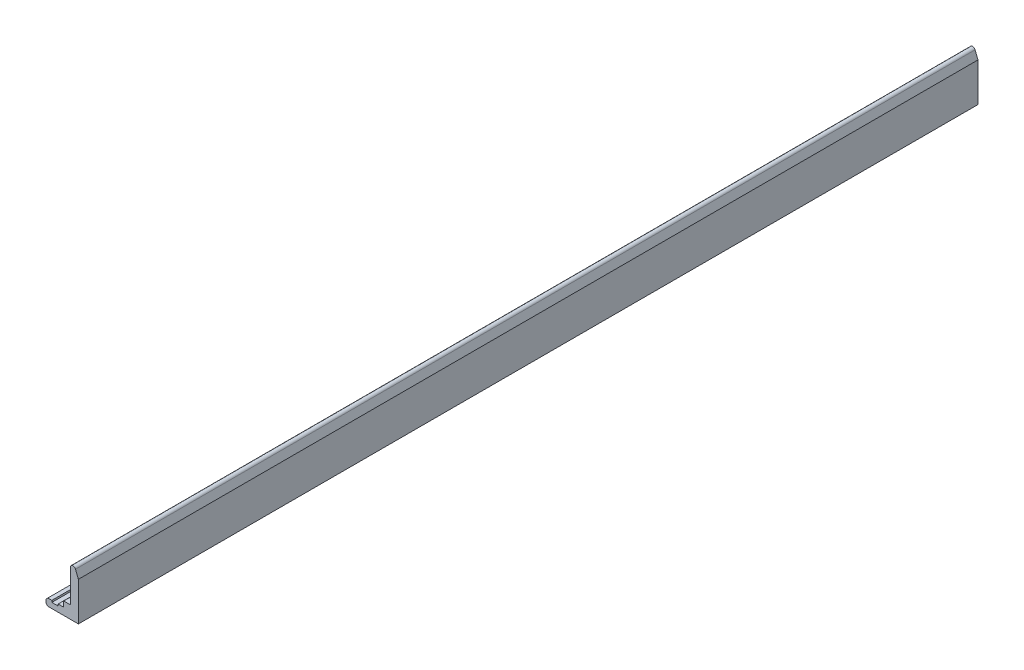
ISO-10303-21;
HEADER;
FILE_DESCRIPTION(('STEP AP214'),'2;1');
FILE_NAME('part.step','',(''),(''),'','','');
FILE_SCHEMA(('AUTOMOTIVE_DESIGN { 1 0 10303 214 1 1 1 1 }'));
ENDSEC;
DATA;
#1=APPLICATION_CONTEXT('core data for automotive mechanical design processes');
#2=APPLICATION_PROTOCOL_DEFINITION('international standard','automotive_design',2000,#1);
#3=PRODUCT_CONTEXT('',#1,'mechanical');
#4=PRODUCT('Part','Part','',(#3));
#5=PRODUCT_RELATED_PRODUCT_CATEGORY('part','',(#4));
#6=PRODUCT_DEFINITION_FORMATION('','',#4);
#7=PRODUCT_DEFINITION_CONTEXT('part definition',#1,'design');
#8=PRODUCT_DEFINITION('design','',#6,#7);
#9=PRODUCT_DEFINITION_SHAPE('','',#8);
#10=(LENGTH_UNIT() NAMED_UNIT(*) SI_UNIT(.MILLI.,.METRE.));
#11=(NAMED_UNIT(*) PLANE_ANGLE_UNIT() SI_UNIT($,.RADIAN.));
#12=(NAMED_UNIT(*) SI_UNIT($,.STERADIAN.) SOLID_ANGLE_UNIT());
#13=UNCERTAINTY_MEASURE_WITH_UNIT(LENGTH_MEASURE(1.E-05),#10,'distance_accuracy_value','');
#14=(GEOMETRIC_REPRESENTATION_CONTEXT(3) GLOBAL_UNCERTAINTY_ASSIGNED_CONTEXT((#13)) GLOBAL_UNIT_ASSIGNED_CONTEXT((#10,
#11,#12)) REPRESENTATION_CONTEXT('',''));
#15=CARTESIAN_POINT('',(0.,0.,0.));
#16=DIRECTION('',(0.,0.,1.));
#17=DIRECTION('',(1.,0.,0.));
#18=AXIS2_PLACEMENT_3D('',#15,#16,#17);
#19=CARTESIAN_POINT('',(14.694282023086,-76.931131619434,0.));
#20=DIRECTION('',(0.,1.,0.));
#21=DIRECTION('',(-1.,0.,0.));
#22=AXIS2_PLACEMENT_3D('',#19,#20,#21);
#23=PLANE('',#22);
#24=DIRECTION('',(1.,0.,0.));
#25=VECTOR('',#24,1.);
#26=CARTESIAN_POINT('',(14.344282023086,-76.931131619434,100.));
#27=LINE('',#26,#25);
#28=CARTESIAN_POINT('',(13.994282023086,-76.931131619434,100.));
#29=VERTEX_POINT('',#28);
#30=CARTESIAN_POINT('',(14.694282023086,-76.931131619434,100.));
#31=VERTEX_POINT('',#30);
#32=EDGE_CURVE('E253',#29,#31,#27,.T.);
#33=ORIENTED_EDGE('',*,*,#32,.T.);
#34=DIRECTION('',(0.,0.,1.));
#35=VECTOR('',#34,1.);
#36=CARTESIAN_POINT('',(14.694282023086,-76.931131619434,50.));
#37=LINE('',#36,#35);
#38=CARTESIAN_POINT('',(14.694282023086,-76.931131619434,0.));
#39=VERTEX_POINT('',#38);
#40=EDGE_CURVE('E247',#39,#31,#37,.T.);
#41=ORIENTED_EDGE('',*,*,#40,.F.);
#42=DIRECTION('',(-1.,0.,0.));
#43=VECTOR('',#42,1.);
#44=CARTESIAN_POINT('',(14.344282023086,-76.931131619434,0.));
#45=LINE('',#44,#43);
#46=CARTESIAN_POINT('',(13.994282023086,-76.931131619434,0.));
#47=VERTEX_POINT('',#46);
#48=EDGE_CURVE('E261',#39,#47,#45,.T.);
#49=ORIENTED_EDGE('',*,*,#48,.T.);
#50=DIRECTION('',(0.,0.,-1.));
#51=VECTOR('',#50,1.);
#52=CARTESIAN_POINT('',(13.994282023086,-76.931131619434,50.));
#53=LINE('',#52,#51);
#54=EDGE_CURVE('E237',#29,#47,#53,.T.);
#55=ORIENTED_EDGE('',*,*,#54,.F.);
#56=EDGE_LOOP('',(#33,#41,#49,#55));
#57=FACE_BOUND('',#56,.T.);
#58=ADVANCED_FACE('F17',(#57),#23,.T.);
#59=CARTESIAN_POINT('',(14.694282023086,-76.731131619434,0.));
#60=DIRECTION('',(-1.,0.,0.));
#61=DIRECTION('',(0.,-1.,0.));
#62=AXIS2_PLACEMENT_3D('',#59,#60,#61);
#63=PLANE('',#62);
#64=DIRECTION('',(0.,1.,0.));
#65=VECTOR('',#64,1.);
#66=CARTESIAN_POINT('',(14.694282023086,-76.831131619434,100.));
#67=LINE('',#66,#65);
#68=CARTESIAN_POINT('',(14.694282023086,-76.731131619434,100.));
#69=VERTEX_POINT('',#68);
#70=EDGE_CURVE('E244',#31,#69,#67,.T.);
#71=ORIENTED_EDGE('',*,*,#70,.T.);
#72=DIRECTION('',(0.,0.,1.));
#73=VECTOR('',#72,1.);
#74=CARTESIAN_POINT('',(14.694282023086,-76.731131619434,50.));
#75=LINE('',#74,#73);
#76=CARTESIAN_POINT('',(14.694282023086,-76.731131619434,0.));
#77=VERTEX_POINT('',#76);
#78=EDGE_CURVE('E231',#77,#69,#75,.T.);
#79=ORIENTED_EDGE('',*,*,#78,.F.);
#80=DIRECTION('',(0.,-1.,0.));
#81=VECTOR('',#80,1.);
#82=CARTESIAN_POINT('',(14.694282023086,-76.831131619434,0.));
#83=LINE('',#82,#81);
#84=EDGE_CURVE('E250',#77,#39,#83,.T.);
#85=ORIENTED_EDGE('',*,*,#84,.T.);
#86=ORIENTED_EDGE('',*,*,#40,.T.);
#87=EDGE_LOOP('',(#71,#79,#85,#86));
#88=FACE_BOUND('',#87,.T.);
#89=ADVANCED_FACE('F326',(#88),#63,.T.);
#90=CARTESIAN_POINT('',(13.994282023086,-76.931131619434,0.));
#91=DIRECTION('',(1.,0.,0.));
#92=DIRECTION('',(0.,1.,0.));
#93=AXIS2_PLACEMENT_3D('',#90,#91,#92);
#94=PLANE('',#93);
#95=DIRECTION('',(0.,-1.,0.));
#96=VECTOR('',#95,1.);
#97=CARTESIAN_POINT('',(13.994282023086,-76.831131619434,100.));
#98=LINE('',#97,#96);
#99=CARTESIAN_POINT('',(13.994282023086,-76.731131619434,100.));
#100=VERTEX_POINT('',#99);
#101=EDGE_CURVE('E270',#100,#29,#98,.T.);
#102=ORIENTED_EDGE('',*,*,#101,.T.);
#103=ORIENTED_EDGE('',*,*,#54,.T.);
#104=DIRECTION('',(0.,1.,0.));
#105=VECTOR('',#104,1.);
#106=CARTESIAN_POINT('',(13.994282023086,-76.831131619434,0.));
#107=LINE('',#106,#105);
#108=CARTESIAN_POINT('',(13.994282023086,-76.731131619434,0.));
#109=VERTEX_POINT('',#108);
#110=EDGE_CURVE('E246',#47,#109,#107,.T.);
#111=ORIENTED_EDGE('',*,*,#110,.T.);
#112=DIRECTION('',(0.,0.,-1.));
#113=VECTOR('',#112,1.);
#114=CARTESIAN_POINT('',(13.994282023086,-76.731131619434,50.));
#115=LINE('',#114,#113);
#116=EDGE_CURVE('E214',#100,#109,#115,.T.);
#117=ORIENTED_EDGE('',*,*,#116,.F.);
#118=EDGE_LOOP('',(#102,#103,#111,#117));
#119=FACE_BOUND('',#118,.T.);
#120=ADVANCED_FACE('F318',(#119),#94,.T.);
#121=CARTESIAN_POINT('',(15.314282023087,-76.731131619434,0.));
#122=DIRECTION('',(0.,1.,0.));
#123=DIRECTION('',(-1.,0.,0.));
#124=AXIS2_PLACEMENT_3D('',#121,#122,#123);
#125=PLANE('',#124);
#126=DIRECTION('',(1.,0.,0.));
#127=VECTOR('',#126,1.);
#128=CARTESIAN_POINT('',(15.0042820230865,-76.731131619434,100.));
#129=LINE('',#128,#127);
#130=CARTESIAN_POINT('',(15.314282023087,-76.731131619434,100.));
#131=VERTEX_POINT('',#130);
#132=EDGE_CURVE('E225',#69,#131,#129,.T.);
#133=ORIENTED_EDGE('',*,*,#132,.T.);
#134=DIRECTION('',(0.,0.,1.));
#135=VECTOR('',#134,1.);
#136=CARTESIAN_POINT('',(15.314282023087,-76.731131619434,50.));
#137=LINE('',#136,#135);
#138=CARTESIAN_POINT('',(15.314282023087,-76.731131619434,0.));
#139=VERTEX_POINT('',#138);
#140=EDGE_CURVE('E208',#139,#131,#137,.T.);
#141=ORIENTED_EDGE('',*,*,#140,.F.);
#142=DIRECTION('',(-1.,0.,0.));
#143=VECTOR('',#142,1.);
#144=CARTESIAN_POINT('',(15.0042820230865,-76.731131619434,0.));
#145=LINE('',#144,#143);
#146=EDGE_CURVE('E234',#139,#77,#145,.T.);
#147=ORIENTED_EDGE('',*,*,#146,.T.);
#148=ORIENTED_EDGE('',*,*,#78,.T.);
#149=EDGE_LOOP('',(#133,#141,#147,#148));
#150=FACE_BOUND('',#149,.T.);
#151=ADVANCED_FACE('F329',(#150),#125,.T.);
#152=CARTESIAN_POINT('',(13.994282023086,-76.731131619434,0.));
#153=DIRECTION('',(0.,1.,0.));
#154=DIRECTION('',(-1.,0.,0.));
#155=AXIS2_PLACEMENT_3D('',#152,#153,#154);
#156=PLANE('',#155);
#157=DIRECTION('',(1.,0.,0.));
#158=VECTOR('',#157,1.);
#159=CARTESIAN_POINT('',(13.769282023086,-76.731131619434,100.));
#160=LINE('',#159,#158);
#161=CARTESIAN_POINT('',(13.544282023086,-76.731131619434,100.));
#162=VERTEX_POINT('',#161);
#163=EDGE_CURVE('E219',#162,#100,#160,.T.);
#164=ORIENTED_EDGE('',*,*,#163,.T.);
#165=ORIENTED_EDGE('',*,*,#116,.T.);
#166=DIRECTION('',(-1.,0.,0.));
#167=VECTOR('',#166,1.);
#168=CARTESIAN_POINT('',(13.769282023086,-76.731131619434,0.));
#169=LINE('',#168,#167);
#170=CARTESIAN_POINT('',(13.544282023086,-76.731131619434,0.));
#171=VERTEX_POINT('',#170);
#172=EDGE_CURVE('E222',#109,#171,#169,.T.);
#173=ORIENTED_EDGE('',*,*,#172,.T.);
#174=DIRECTION('',(0.,0.,-1.));
#175=VECTOR('',#174,1.);
#176=CARTESIAN_POINT('',(13.544282023086,-76.731131619434,50.));
#177=LINE('',#176,#175);
#178=EDGE_CURVE('E186',#162,#171,#177,.T.);
#179=ORIENTED_EDGE('',*,*,#178,.F.);
#180=EDGE_LOOP('',(#164,#165,#173,#179));
#181=FACE_BOUND('',#180,.T.);
#182=ADVANCED_FACE('F316',(#181),#156,.T.);
#183=CARTESIAN_POINT('',(15.314282023087,-76.131131619434,0.));
#184=DIRECTION('',(-1.,0.,0.));
#185=DIRECTION('',(0.,-1.,0.));
#186=AXIS2_PLACEMENT_3D('',#183,#184,#185);
#187=PLANE('',#186);
#188=DIRECTION('',(0.,1.,0.));
#189=VECTOR('',#188,1.);
#190=CARTESIAN_POINT('',(15.314282023087,-76.431131619434,100.));
#191=LINE('',#190,#189);
#192=CARTESIAN_POINT('',(15.314282023087,-76.131131619434,100.));
#193=VERTEX_POINT('',#192);
#194=EDGE_CURVE('E202',#131,#193,#191,.T.);
#195=ORIENTED_EDGE('',*,*,#194,.T.);
#196=DIRECTION('',(0.,0.,1.));
#197=VECTOR('',#196,1.);
#198=CARTESIAN_POINT('',(15.314282023087,-76.131131619434,50.));
#199=LINE('',#198,#197);
#200=CARTESIAN_POINT('',(15.314282023087,-76.131131619434,0.));
#201=VERTEX_POINT('',#200);
#202=EDGE_CURVE('E185',#201,#193,#199,.T.);
#203=ORIENTED_EDGE('',*,*,#202,.F.);
#204=DIRECTION('',(0.,-1.,0.));
#205=VECTOR('',#204,1.);
#206=CARTESIAN_POINT('',(15.314282023087,-76.431131619434,0.));
#207=LINE('',#206,#205);
#208=EDGE_CURVE('E211',#201,#139,#207,.T.);
#209=ORIENTED_EDGE('',*,*,#208,.T.);
#210=ORIENTED_EDGE('',*,*,#140,.T.);
#211=EDGE_LOOP('',(#195,#203,#209,#210));
#212=FACE_BOUND('',#211,.T.);
#213=ADVANCED_FACE('F333',(#212),#187,.T.);
#214=CARTESIAN_POINT('',(13.544282023086,-76.731131619434,0.));
#215=DIRECTION('',(-0.70710678118656,0.707106781186535,0.));
#216=DIRECTION('',(-0.707106781186535,-0.70710678118656,0.));
#217=AXIS2_PLACEMENT_3D('',#214,#215,#216);
#218=PLANE('',#217);
#219=DIRECTION('',(0.707106781186535,0.70710678118656,0.));
#220=VECTOR('',#219,1.);
#221=CARTESIAN_POINT('',(13.444282023086,-76.831131619434,100.));
#222=LINE('',#221,#220);
#223=CARTESIAN_POINT('',(13.344282023086,-76.931131619434,100.));
#224=VERTEX_POINT('',#223);
#225=EDGE_CURVE('E196',#224,#162,#222,.T.);
#226=ORIENTED_EDGE('',*,*,#225,.T.);
#227=ORIENTED_EDGE('',*,*,#178,.T.);
#228=DIRECTION('',(-0.707106781186535,-0.70710678118656,0.));
#229=VECTOR('',#228,1.);
#230=CARTESIAN_POINT('',(13.444282023086,-76.831131619434,0.));
#231=LINE('',#230,#229);
#232=CARTESIAN_POINT('',(13.344282023086,-76.931131619434,0.));
#233=VERTEX_POINT('',#232);
#234=EDGE_CURVE('E199',#171,#233,#231,.T.);
#235=ORIENTED_EDGE('',*,*,#234,.T.);
#236=DIRECTION('',(0.,0.,-1.));
#237=VECTOR('',#236,1.);
#238=CARTESIAN_POINT('',(13.344282023086,-76.931131619434,50.));
#239=LINE('',#238,#237);
#240=EDGE_CURVE('E132',#224,#233,#239,.T.);
#241=ORIENTED_EDGE('',*,*,#240,.F.);
#242=EDGE_LOOP('',(#226,#227,#235,#241));
#243=FACE_BOUND('',#242,.T.);
#244=ADVANCED_FACE('F311',(#243),#218,.T.);
#245=CARTESIAN_POINT('',(16.044282023086,-76.131131619434,0.));
#246=DIRECTION('',(0.,1.,0.));
#247=DIRECTION('',(-1.,0.,0.));
#248=AXIS2_PLACEMENT_3D('',#245,#246,#247);
#249=PLANE('',#248);
#250=DIRECTION('',(1.,0.,0.));
#251=VECTOR('',#250,1.);
#252=CARTESIAN_POINT('',(15.6792820230865,-76.131131619434,100.));
#253=LINE('',#252,#251);
#254=CARTESIAN_POINT('',(16.044282023086,-76.131131619434,100.));
#255=VERTEX_POINT('',#254);
#256=EDGE_CURVE('E189',#193,#255,#253,.T.);
#257=ORIENTED_EDGE('',*,*,#256,.T.);
#258=DIRECTION('',(0.,0.,1.));
#259=VECTOR('',#258,1.);
#260=CARTESIAN_POINT('',(16.044282023086,-76.131131619434,50.));
#261=LINE('',#260,#259);
#262=CARTESIAN_POINT('',(16.044282023086,-76.131131619434,0.));
#263=VERTEX_POINT('',#262);
#264=EDGE_CURVE('E131',#263,#255,#261,.T.);
#265=ORIENTED_EDGE('',*,*,#264,.F.);
#266=DIRECTION('',(-1.,0.,0.));
#267=VECTOR('',#266,1.);
#268=CARTESIAN_POINT('',(15.6792820230865,-76.131131619434,0.));
#269=LINE('',#268,#267);
#270=EDGE_CURVE('E182',#263,#201,#269,.T.);
#271=ORIENTED_EDGE('',*,*,#270,.T.);
#272=ORIENTED_EDGE('',*,*,#202,.T.);
#273=EDGE_LOOP('',(#257,#265,#271,#272));
#274=FACE_BOUND('',#273,.T.);
#275=ADVANCED_FACE('F335',(#274),#249,.T.);
#276=CARTESIAN_POINT('',(13.344282023086,-76.931131619434,0.));
#277=DIRECTION('',(-1.,0.,0.));
#278=DIRECTION('',(0.,-1.,0.));
#279=AXIS2_PLACEMENT_3D('',#276,#277,#278);
#280=PLANE('',#279);
#281=DIRECTION('',(0.,1.,0.));
#282=VECTOR('',#281,1.);
#283=CARTESIAN_POINT('',(13.344282023086,-77.131131619434,100.));
#284=LINE('',#283,#282);
#285=CARTESIAN_POINT('',(13.344282023086,-77.331131619434,100.));
#286=VERTEX_POINT('',#285);
#287=EDGE_CURVE('E181',#286,#224,#284,.T.);
#288=ORIENTED_EDGE('',*,*,#287,.T.);
#289=ORIENTED_EDGE('',*,*,#240,.T.);
#290=DIRECTION('',(0.,-1.,0.));
#291=VECTOR('',#290,1.);
#292=CARTESIAN_POINT('',(13.344282023086,-77.131131619434,0.));
#293=LINE('',#292,#291);
#294=CARTESIAN_POINT('',(13.344282023086,-77.331131619434,0.));
#295=VERTEX_POINT('',#294);
#296=EDGE_CURVE('E191',#233,#295,#293,.T.);
#297=ORIENTED_EDGE('',*,*,#296,.T.);
#298=DIRECTION('',(0.,0.,-1.));
#299=VECTOR('',#298,1.);
#300=CARTESIAN_POINT('',(13.344282023086,-77.331131619434,50.));
#301=LINE('',#300,#299);
#302=EDGE_CURVE('E140',#286,#295,#301,.T.);
#303=ORIENTED_EDGE('',*,*,#302,.F.);
#304=EDGE_LOOP('',(#288,#289,#297,#303));
#305=FACE_BOUND('',#304,.T.);
#306=ADVANCED_FACE('F313',(#305),#280,.T.);
#307=CARTESIAN_POINT('',(16.3442820230878,-72.5311316194346,0.));
#308=DIRECTION('',(0.,0.,1.));
#309=DIRECTION('',(1.,0.,0.));
#310=AXIS2_PLACEMENT_3D('',#307,#308,#309);
#311=CYLINDRICAL_SURFACE('',#310,0.299999999999699);
#312=CARTESIAN_POINT('',(16.3442820230878,-72.5311316194346,100.));
#313=DIRECTION('',(0.,0.,1.));
#314=DIRECTION('',(1.,0.,0.));
#315=AXIS2_PLACEMENT_3D('',#312,#313,#314);
#316=CIRCLE('',#315,0.299999999999699);
#317=CARTESIAN_POINT('',(16.044282023086,-72.5311316176373,100.));
#318=VERTEX_POINT('',#317);
#319=CARTESIAN_POINT('',(16.623192323807,-72.4206370758935,100.));
#320=VERTEX_POINT('',#319);
#321=EDGE_CURVE('E21',#318,#320,#316,.F.);
#322=ORIENTED_EDGE('',*,*,#321,.T.);
#323=DIRECTION('',(0.,0.,1.));
#324=VECTOR('',#323,1.);
#325=CARTESIAN_POINT('',(16.623192323787,-72.420637075843,50.));
#326=LINE('',#325,#324);
#327=CARTESIAN_POINT('',(16.623192323807,-72.4206370758935,0.));
#328=VERTEX_POINT('',#327);
#329=EDGE_CURVE('E146',#328,#320,#326,.T.);
#330=ORIENTED_EDGE('',*,*,#329,.F.);
#331=CARTESIAN_POINT('',(16.3442820230878,-72.5311316194346,0.));
#332=DIRECTION('',(0.,0.,-1.));
#333=DIRECTION('',(-1.,0.,0.));
#334=AXIS2_PLACEMENT_3D('',#331,#332,#333);
#335=CIRCLE('',#334,0.299999999999699);
#336=CARTESIAN_POINT('',(16.044282023086,-72.5311316176373,0.));
#337=VERTEX_POINT('',#336);
#338=EDGE_CURVE('E136',#337,#328,#335,.T.);
#339=ORIENTED_EDGE('',*,*,#338,.F.);
#340=DIRECTION('',(0.,0.,-1.));
#341=VECTOR('',#340,1.);
#342=CARTESIAN_POINT('',(16.044282023086,-72.53113161584,50.));
#343=LINE('',#342,#341);
#344=EDGE_CURVE('E134',#318,#337,#343,.T.);
#345=ORIENTED_EDGE('',*,*,#344,.F.);
#346=EDGE_LOOP('',(#322,#330,#339,#345));
#347=FACE_BOUND('',#346,.T.);
#348=ADVANCED_FACE('F135',(#347),#311,.T.);
#349=CARTESIAN_POINT('',(16.044282023086,-72.53113161584,0.));
#350=DIRECTION('',(-1.,0.,0.));
#351=DIRECTION('',(0.,-1.,0.));
#352=AXIS2_PLACEMENT_3D('',#349,#350,#351);
#353=PLANE('',#352);
#354=DIRECTION('',(0.,-1.,0.));
#355=VECTOR('',#354,1.);
#356=CARTESIAN_POINT('',(16.044282023086,-74.8811314644625,100.));
#357=LINE('',#356,#355);
#358=EDGE_CURVE('E126',#318,#255,#357,.T.);
#359=ORIENTED_EDGE('',*,*,#358,.F.);
#360=ORIENTED_EDGE('',*,*,#344,.T.);
#361=DIRECTION('',(0.,1.,0.));
#362=VECTOR('',#361,1.);
#363=CARTESIAN_POINT('',(16.044282023086,-74.8811314644625,0.));
#364=LINE('',#363,#362);
#365=EDGE_CURVE('E154',#263,#337,#364,.T.);
#366=ORIENTED_EDGE('',*,*,#365,.F.);
#367=ORIENTED_EDGE('',*,*,#264,.T.);
#368=EDGE_LOOP('',(#359,#360,#366,#367));
#369=FACE_BOUND('',#368,.T.);
#370=ADVANCED_FACE('F143',(#369),#353,.T.);
#371=CARTESIAN_POINT('',(13.344282023086,-77.331131619434,0.));
#372=DIRECTION('',(-0.707106781186535,-0.70710678118656,0.));
#373=DIRECTION('',(0.70710678118656,-0.707106781186535,0.));
#374=AXIS2_PLACEMENT_3D('',#371,#372,#373);
#375=PLANE('',#374);
#376=DIRECTION('',(0.707106781186535,-0.70710678118656,0.));
#377=VECTOR('',#376,1.);
#378=CARTESIAN_POINT('',(13.344282023086,-77.331131619434,100.));
#379=LINE('',#378,#377);
#380=CARTESIAN_POINT('',(13.544282023086,-77.531131619434,100.));
#381=VERTEX_POINT('',#380);
#382=EDGE_CURVE('E145',#286,#381,#379,.T.);
#383=ORIENTED_EDGE('',*,*,#382,.F.);
#384=ORIENTED_EDGE('',*,*,#302,.T.);
#385=DIRECTION('',(-0.707106781186557,0.707106781186538,0.));
#386=VECTOR('',#385,1.);
#387=CARTESIAN_POINT('',(13.544282023086,-77.531131619434,0.));
#388=LINE('',#387,#386);
#389=CARTESIAN_POINT('',(13.544282023086,-77.531131619434,0.));
#390=VERTEX_POINT('',#389);
#391=EDGE_CURVE('E156',#390,#295,#388,.T.);
#392=ORIENTED_EDGE('',*,*,#391,.F.);
#393=DIRECTION('',(0.,0.,-1.));
#394=VECTOR('',#393,1.);
#395=CARTESIAN_POINT('',(13.544282023086,-77.531131619434,50.));
#396=LINE('',#395,#394);
#397=EDGE_CURVE('E176',#381,#390,#396,.T.);
#398=ORIENTED_EDGE('',*,*,#397,.F.);
#399=EDGE_LOOP('',(#383,#384,#392,#398));
#400=FACE_BOUND('',#399,.T.);
#401=ADVANCED_FACE('F306',(#400),#375,.T.);
#402=CARTESIAN_POINT('',(13.254282734766,-72.098630184155,0.));
#403=DIRECTION('',(0.,0.,-1.));
#404=DIRECTION('',(1.,0.,0.));
#405=AXIS2_PLACEMENT_3D('',#402,#403,#404);
#406=PLANE('',#405);
#407=ORIENTED_EDGE('',*,*,#270,.F.);
#408=ORIENTED_EDGE('',*,*,#365,.T.);
#409=ORIENTED_EDGE('',*,*,#338,.T.);
#410=DIRECTION('',(-0.36831514496955,0.929701002465879,0.));
#411=VECTOR('',#410,1.);
#412=CARTESIAN_POINT('',(16.7837371734365,-72.8258843476385,0.));
#413=LINE('',#412,#411);
#414=CARTESIAN_POINT('',(16.944282023086,-73.231131619434,0.));
#415=VERTEX_POINT('',#414);
#416=EDGE_CURVE('E149',#415,#328,#413,.T.);
#417=ORIENTED_EDGE('',*,*,#416,.F.);
#418=DIRECTION('',(0.,1.,0.));
#419=VECTOR('',#418,1.);
#420=CARTESIAN_POINT('',(16.944282023086,-75.381131619434,0.));
#421=LINE('',#420,#419);
#422=CARTESIAN_POINT('',(16.944282023086,-77.531131619434,0.));
#423=VERTEX_POINT('',#422);
#424=EDGE_CURVE('E164',#423,#415,#421,.T.);
#425=ORIENTED_EDGE('',*,*,#424,.F.);
#426=DIRECTION('',(1.,0.,0.));
#427=VECTOR('',#426,1.);
#428=CARTESIAN_POINT('',(15.244282023086,-77.531131619434,0.));
#429=LINE('',#428,#427);
#430=EDGE_CURVE('E281',#390,#423,#429,.T.);
#431=ORIENTED_EDGE('',*,*,#430,.F.);
#432=ORIENTED_EDGE('',*,*,#391,.T.);
#433=ORIENTED_EDGE('',*,*,#296,.F.);
#434=ORIENTED_EDGE('',*,*,#234,.F.);
#435=ORIENTED_EDGE('',*,*,#172,.F.);
#436=ORIENTED_EDGE('',*,*,#110,.F.);
#437=ORIENTED_EDGE('',*,*,#48,.F.);
#438=ORIENTED_EDGE('',*,*,#84,.F.);
#439=ORIENTED_EDGE('',*,*,#146,.F.);
#440=ORIENTED_EDGE('',*,*,#208,.F.);
#441=EDGE_LOOP('',(#407,#408,#409,#417,#425,#431,#432,#433,#434,#435,#436,#437,#438,#439,#440));
#442=FACE_BOUND('',#441,.T.);
#443=ADVANCED_FACE('F295',(#442),#406,.T.);
#444=CARTESIAN_POINT('',(16.944282023086,-73.231131619434,0.));
#445=DIRECTION('',(0.929701002465879,0.36831514496955,0.));
#446=DIRECTION('',(-0.36831514496955,0.929701002465879,0.));
#447=AXIS2_PLACEMENT_3D('',#444,#445,#446);
#448=PLANE('',#447);
#449=DIRECTION('',(-0.36831514496955,0.929701002465879,0.));
#450=VECTOR('',#449,1.);
#451=CARTESIAN_POINT('',(16.944282023086,-73.231131619434,100.));
#452=LINE('',#451,#450);
#453=CARTESIAN_POINT('',(16.944282023086,-73.231131619434,100.));
#454=VERTEX_POINT('',#453);
#455=EDGE_CURVE('E127',#454,#320,#452,.T.);
#456=ORIENTED_EDGE('',*,*,#455,.F.);
#457=DIRECTION('',(0.,0.,1.));
#458=VECTOR('',#457,1.);
#459=CARTESIAN_POINT('',(16.944282023086,-73.231131619434,50.));
#460=LINE('',#459,#458);
#461=EDGE_CURVE('E161',#415,#454,#460,.T.);
#462=ORIENTED_EDGE('',*,*,#461,.F.);
#463=ORIENTED_EDGE('',*,*,#416,.T.);
#464=ORIENTED_EDGE('',*,*,#329,.T.);
#465=EDGE_LOOP('',(#456,#462,#463,#464));
#466=FACE_BOUND('',#465,.T.);
#467=ADVANCED_FACE('F298',(#466),#448,.T.);
#468=CARTESIAN_POINT('',(17.034282646551,-77.66363274477,100.));
#469=DIRECTION('',(0.,0.,1.));
#470=DIRECTION('',(0.,1.,0.));
#471=AXIS2_PLACEMENT_3D('',#468,#469,#470);
#472=PLANE('',#471);
#473=ORIENTED_EDGE('',*,*,#455,.T.);
#474=ORIENTED_EDGE('',*,*,#321,.F.);
#475=ORIENTED_EDGE('',*,*,#358,.T.);
#476=ORIENTED_EDGE('',*,*,#256,.F.);
#477=ORIENTED_EDGE('',*,*,#194,.F.);
#478=ORIENTED_EDGE('',*,*,#132,.F.);
#479=ORIENTED_EDGE('',*,*,#70,.F.);
#480=ORIENTED_EDGE('',*,*,#32,.F.);
#481=ORIENTED_EDGE('',*,*,#101,.F.);
#482=ORIENTED_EDGE('',*,*,#163,.F.);
#483=ORIENTED_EDGE('',*,*,#225,.F.);
#484=ORIENTED_EDGE('',*,*,#287,.F.);
#485=ORIENTED_EDGE('',*,*,#382,.T.);
#486=DIRECTION('',(-1.,0.,0.));
#487=VECTOR('',#486,1.);
#488=CARTESIAN_POINT('',(15.244282023086,-77.531131619434,100.));
#489=LINE('',#488,#487);
#490=CARTESIAN_POINT('',(16.944282023086,-77.531131619434,100.));
#491=VERTEX_POINT('',#490);
#492=EDGE_CURVE('E36',#491,#381,#489,.T.);
#493=ORIENTED_EDGE('',*,*,#492,.F.);
#494=DIRECTION('',(0.,-1.,0.));
#495=VECTOR('',#494,1.);
#496=CARTESIAN_POINT('',(16.944282023086,-75.381131619434,100.));
#497=LINE('',#496,#495);
#498=EDGE_CURVE('E27',#454,#491,#497,.T.);
#499=ORIENTED_EDGE('',*,*,#498,.F.);
#500=EDGE_LOOP('',(#473,#474,#475,#476,#477,#478,#479,#480,#481,#482,#483,#484,#485,#493,#499));
#501=FACE_BOUND('',#500,.T.);
#502=ADVANCED_FACE('F123',(#501),#472,.T.);
#503=CARTESIAN_POINT('',(13.544282023086,-77.531131619434,0.));
#504=DIRECTION('',(0.,-1.,0.));
#505=DIRECTION('',(1.,0.,0.));
#506=AXIS2_PLACEMENT_3D('',#503,#504,#505);
#507=PLANE('',#506);
#508=ORIENTED_EDGE('',*,*,#492,.T.);
#509=ORIENTED_EDGE('',*,*,#397,.T.);
#510=ORIENTED_EDGE('',*,*,#430,.T.);
#511=DIRECTION('',(0.,0.,-1.));
#512=VECTOR('',#511,1.);
#513=CARTESIAN_POINT('',(16.944282023086,-77.531131619434,50.));
#514=LINE('',#513,#512);
#515=EDGE_CURVE('E11',#491,#423,#514,.T.);
#516=ORIENTED_EDGE('',*,*,#515,.F.);
#517=EDGE_LOOP('',(#508,#509,#510,#516));
#518=FACE_BOUND('',#517,.T.);
#519=ADVANCED_FACE('F302',(#518),#507,.T.);
#520=CARTESIAN_POINT('',(16.944282023086,-77.531131619434,0.));
#521=DIRECTION('',(1.,0.,0.));
#522=DIRECTION('',(0.,1.,0.));
#523=AXIS2_PLACEMENT_3D('',#520,#521,#522);
#524=PLANE('',#523);
#525=ORIENTED_EDGE('',*,*,#498,.T.);
#526=ORIENTED_EDGE('',*,*,#515,.T.);
#527=ORIENTED_EDGE('',*,*,#424,.T.);
#528=ORIENTED_EDGE('',*,*,#461,.T.);
#529=EDGE_LOOP('',(#525,#526,#527,#528));
#530=FACE_BOUND('',#529,.T.);
#531=ADVANCED_FACE('F19',(#530),#524,.T.);
#532=CLOSED_SHELL('',(#58,#89,#120,#151,#182,#213,#244,#275,#306,#348,#370,#401,#443,#467,#502,
#519,#531));
#533=MANIFOLD_SOLID_BREP('B1',#532);
#534=ADVANCED_BREP_SHAPE_REPRESENTATION('',(#18,#533),#14);
#535=SHAPE_DEFINITION_REPRESENTATION(#9,#534);
ENDSEC;
END-ISO-10303-21;
